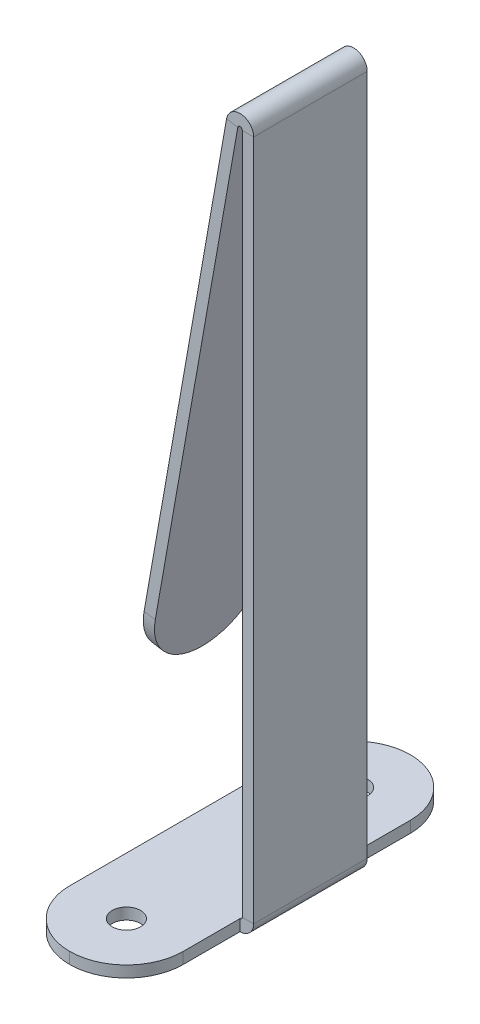
ISO-10303-21;
HEADER;
FILE_DESCRIPTION(('STEP AP214'),'2;1');
FILE_NAME('part.step','',(''),(''),'','','');
FILE_SCHEMA(('AUTOMOTIVE_DESIGN { 1 0 10303 214 1 1 1 1 }'));
ENDSEC;
DATA;
#1=APPLICATION_CONTEXT('core data for automotive mechanical design processes');
#2=APPLICATION_PROTOCOL_DEFINITION('international standard','automotive_design',2000,#1);
#3=PRODUCT_CONTEXT('',#1,'mechanical');
#4=PRODUCT('Part','Part','',(#3));
#5=PRODUCT_RELATED_PRODUCT_CATEGORY('part','',(#4));
#6=PRODUCT_DEFINITION_FORMATION('','',#4);
#7=PRODUCT_DEFINITION_CONTEXT('part definition',#1,'design');
#8=PRODUCT_DEFINITION('design','',#6,#7);
#9=PRODUCT_DEFINITION_SHAPE('','',#8);
#10=(LENGTH_UNIT() NAMED_UNIT(*) SI_UNIT(.MILLI.,.METRE.));
#11=(NAMED_UNIT(*) PLANE_ANGLE_UNIT() SI_UNIT($,.RADIAN.));
#12=(NAMED_UNIT(*) SI_UNIT($,.STERADIAN.) SOLID_ANGLE_UNIT());
#13=UNCERTAINTY_MEASURE_WITH_UNIT(LENGTH_MEASURE(1.E-05),#10,'distance_accuracy_value','');
#14=(GEOMETRIC_REPRESENTATION_CONTEXT(3) GLOBAL_UNCERTAINTY_ASSIGNED_CONTEXT((#13)) GLOBAL_UNIT_ASSIGNED_CONTEXT((#10,
#11,#12)) REPRESENTATION_CONTEXT('',''));
#15=CARTESIAN_POINT('',(0.,0.,0.));
#16=DIRECTION('',(0.,0.,1.));
#17=DIRECTION('',(1.,0.,0.));
#18=AXIS2_PLACEMENT_3D('',#15,#16,#17);
#19=CARTESIAN_POINT('',(14.224,-13.8424379345207,0.));
#20=DIRECTION('',(1.,0.,0.));
#21=DIRECTION('',(0.,0.,-1.));
#22=AXIS2_PLACEMENT_3D('',#19,#20,#21);
#23=PLANE('',#22);
#24=DIRECTION('',(0.,-1.,0.));
#25=VECTOR('',#24,1.);
#26=CARTESIAN_POINT('',(14.224,-1.14243793452066,-25.4));
#27=LINE('',#26,#25);
#28=CARTESIAN_POINT('',(14.2239999999997,76.454,-25.4));
#29=VERTEX_POINT('',#28);
#30=CARTESIAN_POINT('',(14.224,0.254000000000003,-25.4));
#31=VERTEX_POINT('',#30);
#32=EDGE_CURVE('E51',#29,#31,#27,.T.);
#33=ORIENTED_EDGE('',*,*,#32,.F.);
#34=DIRECTION('',(0.,0.,1.));
#35=VECTOR('',#34,1.);
#36=CARTESIAN_POINT('',(14.2239999999997,76.454,0.));
#37=LINE('',#36,#35);
#38=CARTESIAN_POINT('',(14.2239999999997,76.454,-12.7));
#39=VERTEX_POINT('',#38);
#40=EDGE_CURVE('E326',#29,#39,#37,.T.);
#41=ORIENTED_EDGE('',*,*,#40,.T.);
#42=DIRECTION('',(0.,1.,0.));
#43=VECTOR('',#42,1.);
#44=CARTESIAN_POINT('',(14.224,-1.14243793452066,-12.7));
#45=LINE('',#44,#43);
#46=CARTESIAN_POINT('',(14.224,0.254000000000008,-12.7));
#47=VERTEX_POINT('',#46);
#48=EDGE_CURVE('E333',#47,#39,#45,.T.);
#49=ORIENTED_EDGE('',*,*,#48,.F.);
#50=DIRECTION('',(0.,0.,1.));
#51=VECTOR('',#50,1.);
#52=CARTESIAN_POINT('',(14.224,0.254000000000004,0.));
#53=LINE('',#52,#51);
#54=EDGE_CURVE('E315',#31,#47,#53,.T.);
#55=ORIENTED_EDGE('',*,*,#54,.F.);
#56=EDGE_LOOP('',(#33,#41,#49,#55));
#57=FACE_BOUND('',#56,.T.);
#58=ADVANCED_FACE('F47',(#57),#23,.T.);
#59=CARTESIAN_POINT('',(14.224,-1.14243793452066,-12.7));
#60=DIRECTION('',(0.,0.,1.));
#61=DIRECTION('',(0.,1.,0.));
#62=AXIS2_PLACEMENT_3D('',#59,#60,#61);
#63=PLANE('',#62);
#64=ORIENTED_EDGE('',*,*,#48,.T.);
#65=DIRECTION('',(-1.,0.,0.));
#66=VECTOR('',#65,1.);
#67=CARTESIAN_POINT('',(14.2239999999997,76.454,-12.7));
#68=LINE('',#67,#66);
#69=CARTESIAN_POINT('',(12.9539999999997,76.454,-12.7));
#70=VERTEX_POINT('',#69);
#71=EDGE_CURVE('E12',#39,#70,#68,.T.);
#72=ORIENTED_EDGE('',*,*,#71,.T.);
#73=DIRECTION('',(0.,1.,0.));
#74=VECTOR('',#73,1.);
#75=CARTESIAN_POINT('',(12.954,-1.14243793452067,-12.7));
#76=LINE('',#75,#74);
#77=CARTESIAN_POINT('',(12.954,0.253999999999999,-12.7));
#78=VERTEX_POINT('',#77);
#79=EDGE_CURVE('E246',#78,#70,#76,.T.);
#80=ORIENTED_EDGE('',*,*,#79,.F.);
#81=DIRECTION('',(-1.,0.,0.));
#82=VECTOR('',#81,1.);
#83=CARTESIAN_POINT('',(14.224,0.254000000000004,-12.7));
#84=LINE('',#83,#82);
#85=EDGE_CURVE('E318',#47,#78,#84,.T.);
#86=ORIENTED_EDGE('',*,*,#85,.F.);
#87=EDGE_LOOP('',(#64,#72,#80,#86));
#88=FACE_BOUND('',#87,.T.);
#89=ADVANCED_FACE('F49',(#88),#63,.T.);
#90=CARTESIAN_POINT('',(14.224,-1.14243793452066,-25.4));
#91=DIRECTION('',(0.,0.,-1.));
#92=DIRECTION('',(0.,-1.,0.));
#93=AXIS2_PLACEMENT_3D('',#90,#91,#92);
#94=PLANE('',#93);
#95=DIRECTION('',(0.,-1.,0.));
#96=VECTOR('',#95,1.);
#97=CARTESIAN_POINT('',(12.954,-1.14243793452067,-25.4));
#98=LINE('',#97,#96);
#99=CARTESIAN_POINT('',(12.9539999999997,76.454,-25.4));
#100=VERTEX_POINT('',#99);
#101=CARTESIAN_POINT('',(12.954,0.253999999999999,-25.4));
#102=VERTEX_POINT('',#101);
#103=EDGE_CURVE('E70',#100,#102,#98,.T.);
#104=ORIENTED_EDGE('',*,*,#103,.F.);
#105=DIRECTION('',(1.,0.,0.));
#106=VECTOR('',#105,1.);
#107=CARTESIAN_POINT('',(14.2239999999997,76.454,-25.4));
#108=LINE('',#107,#106);
#109=EDGE_CURVE('E329',#100,#29,#108,.T.);
#110=ORIENTED_EDGE('',*,*,#109,.T.);
#111=ORIENTED_EDGE('',*,*,#32,.T.);
#112=DIRECTION('',(1.,0.,0.));
#113=VECTOR('',#112,1.);
#114=CARTESIAN_POINT('',(14.224,0.254000000000004,-25.4));
#115=LINE('',#114,#113);
#116=EDGE_CURVE('E323',#102,#31,#115,.T.);
#117=ORIENTED_EDGE('',*,*,#116,.F.);
#118=EDGE_LOOP('',(#104,#110,#111,#117));
#119=FACE_BOUND('',#118,.T.);
#120=ADVANCED_FACE('F351',(#119),#94,.T.);
#121=CARTESIAN_POINT('',(12.954,-13.8424379345207,0.));
#122=DIRECTION('',(1.,0.,0.));
#123=DIRECTION('',(0.,0.,-1.));
#124=AXIS2_PLACEMENT_3D('',#121,#122,#123);
#125=PLANE('',#124);
#126=DIRECTION('',(0.,0.,1.));
#127=VECTOR('',#126,1.);
#128=CARTESIAN_POINT('',(12.9539999999997,76.454,0.));
#129=LINE('',#128,#127);
#130=EDGE_CURVE('E56',#100,#70,#129,.T.);
#131=ORIENTED_EDGE('',*,*,#130,.F.);
#132=ORIENTED_EDGE('',*,*,#103,.T.);
#133=DIRECTION('',(0.,0.,1.));
#134=VECTOR('',#133,1.);
#135=CARTESIAN_POINT('',(12.954,0.253999999999999,0.));
#136=LINE('',#135,#134);
#137=EDGE_CURVE('E321',#102,#78,#136,.T.);
#138=ORIENTED_EDGE('',*,*,#137,.T.);
#139=ORIENTED_EDGE('',*,*,#79,.T.);
#140=EDGE_LOOP('',(#131,#132,#138,#139));
#141=FACE_BOUND('',#140,.T.);
#142=ADVANCED_FACE('F337',(#141),#125,.F.);
#143=CARTESIAN_POINT('',(6.35,-1.27,-31.75));
#144=DIRECTION('',(0.,1.,0.));
#145=DIRECTION('',(0.,0.,1.));
#146=AXIS2_PLACEMENT_3D('',#143,#144,#145);
#147=CYLINDRICAL_SURFACE('',#146,6.35);
#148=CARTESIAN_POINT('',(6.35,-1.27,-31.75));
#149=DIRECTION('',(0.,-1.,0.));
#150=DIRECTION('',(0.,0.,-1.));
#151=AXIS2_PLACEMENT_3D('',#148,#149,#150);
#152=CIRCLE('',#151,6.35);
#153=CARTESIAN_POINT('',(6.35,-1.27,-38.1));
#154=VERTEX_POINT('',#153);
#155=CARTESIAN_POINT('',(12.7,-1.27,-31.75));
#156=VERTEX_POINT('',#155);
#157=EDGE_CURVE('E276',#154,#156,#152,.T.);
#158=ORIENTED_EDGE('',*,*,#157,.F.);
#159=DIRECTION('',(0.,1.,0.));
#160=VECTOR('',#159,1.);
#161=CARTESIAN_POINT('',(6.35,-1.27,-38.1));
#162=LINE('',#161,#160);
#163=CARTESIAN_POINT('',(6.35,0.,-38.1));
#164=VERTEX_POINT('',#163);
#165=EDGE_CURVE('E309',#154,#164,#162,.T.);
#166=ORIENTED_EDGE('',*,*,#165,.T.);
#167=CARTESIAN_POINT('',(6.35,0.,-31.75));
#168=DIRECTION('',(0.,-1.,0.));
#169=DIRECTION('',(0.,0.,-1.));
#170=AXIS2_PLACEMENT_3D('',#167,#168,#169);
#171=CIRCLE('',#170,6.35);
#172=CARTESIAN_POINT('',(12.7,0.,-31.75));
#173=VERTEX_POINT('',#172);
#174=EDGE_CURVE('E262',#173,#164,#171,.F.);
#175=ORIENTED_EDGE('',*,*,#174,.F.);
#176=DIRECTION('',(0.,1.,0.));
#177=VECTOR('',#176,1.);
#178=CARTESIAN_POINT('',(12.7,-1.27,-31.75));
#179=LINE('',#178,#177);
#180=EDGE_CURVE('E243',#156,#173,#179,.T.);
#181=ORIENTED_EDGE('',*,*,#180,.F.);
#182=EDGE_LOOP('',(#158,#166,#175,#181));
#183=FACE_BOUND('',#182,.T.);
#184=ADVANCED_FACE('F385',(#183),#147,.T.);
#185=CARTESIAN_POINT('',(6.35,-1.27,-31.75));
#186=DIRECTION('',(0.,1.,0.));
#187=DIRECTION('',(0.,0.,1.));
#188=AXIS2_PLACEMENT_3D('',#185,#186,#187);
#189=CYLINDRICAL_SURFACE('',#188,6.35);
#190=ORIENTED_EDGE('',*,*,#165,.F.);
#191=CARTESIAN_POINT('',(6.35,-1.27,-31.75));
#192=DIRECTION('',(0.,-1.,0.));
#193=DIRECTION('',(0.,0.,-1.));
#194=AXIS2_PLACEMENT_3D('',#191,#192,#193);
#195=CIRCLE('',#194,6.35);
#196=CARTESIAN_POINT('',(0.,-1.27,-31.75));
#197=VERTEX_POINT('',#196);
#198=EDGE_CURVE('E278',#197,#154,#195,.T.);
#199=ORIENTED_EDGE('',*,*,#198,.F.);
#200=DIRECTION('',(0.,1.,0.));
#201=VECTOR('',#200,1.);
#202=CARTESIAN_POINT('',(0.,-1.27,-31.75));
#203=LINE('',#202,#201);
#204=CARTESIAN_POINT('',(0.,0.,-31.75));
#205=VERTEX_POINT('',#204);
#206=EDGE_CURVE('E302',#205,#197,#203,.F.);
#207=ORIENTED_EDGE('',*,*,#206,.F.);
#208=CARTESIAN_POINT('',(6.35,0.,-31.75));
#209=DIRECTION('',(0.,-1.,0.));
#210=DIRECTION('',(0.,0.,-1.));
#211=AXIS2_PLACEMENT_3D('',#208,#209,#210);
#212=CIRCLE('',#211,6.35);
#213=EDGE_CURVE('E260',#164,#205,#212,.F.);
#214=ORIENTED_EDGE('',*,*,#213,.F.);
#215=EDGE_LOOP('',(#190,#199,#207,#214));
#216=FACE_BOUND('',#215,.T.);
#217=ADVANCED_FACE('F389',(#216),#189,.T.);
#218=CARTESIAN_POINT('',(0.,-1.27,0.));
#219=DIRECTION('',(-1.,0.,0.));
#220=DIRECTION('',(0.,0.,1.));
#221=AXIS2_PLACEMENT_3D('',#218,#219,#220);
#222=PLANE('',#221);
#223=DIRECTION('',(0.,0.,1.));
#224=VECTOR('',#223,1.);
#225=CARTESIAN_POINT('',(0.,-1.27,0.));
#226=LINE('',#225,#224);
#227=CARTESIAN_POINT('',(0.,-1.27,-6.35));
#228=VERTEX_POINT('',#227);
#229=EDGE_CURVE('E306',#197,#228,#226,.T.);
#230=ORIENTED_EDGE('',*,*,#229,.T.);
#231=DIRECTION('',(0.,1.,0.));
#232=VECTOR('',#231,1.);
#233=CARTESIAN_POINT('',(0.,-1.27,-6.35));
#234=LINE('',#233,#232);
#235=CARTESIAN_POINT('',(0.,0.,-6.35));
#236=VERTEX_POINT('',#235);
#237=EDGE_CURVE('E304',#228,#236,#234,.T.);
#238=ORIENTED_EDGE('',*,*,#237,.T.);
#239=DIRECTION('',(0.,0.,1.));
#240=VECTOR('',#239,1.);
#241=CARTESIAN_POINT('',(0.,0.,0.));
#242=LINE('',#241,#240);
#243=EDGE_CURVE('E257',#205,#236,#242,.T.);
#244=ORIENTED_EDGE('',*,*,#243,.F.);
#245=ORIENTED_EDGE('',*,*,#206,.T.);
#246=EDGE_LOOP('',(#230,#238,#244,#245));
#247=FACE_BOUND('',#246,.T.);
#248=ADVANCED_FACE('F395',(#247),#222,.T.);
#249=CARTESIAN_POINT('',(6.35,-1.27,-6.35));
#250=DIRECTION('',(0.,1.,0.));
#251=DIRECTION('',(0.,0.,1.));
#252=AXIS2_PLACEMENT_3D('',#249,#250,#251);
#253=CYLINDRICAL_SURFACE('',#252,6.35);
#254=ORIENTED_EDGE('',*,*,#237,.F.);
#255=CARTESIAN_POINT('',(6.35,-1.27,-6.35));
#256=DIRECTION('',(0.,-1.,0.));
#257=DIRECTION('',(0.,0.,-1.));
#258=AXIS2_PLACEMENT_3D('',#255,#256,#257);
#259=CIRCLE('',#258,6.35);
#260=CARTESIAN_POINT('',(6.35,-1.27,0.));
#261=VERTEX_POINT('',#260);
#262=EDGE_CURVE('E280',#261,#228,#259,.T.);
#263=ORIENTED_EDGE('',*,*,#262,.F.);
#264=DIRECTION('',(0.,1.,0.));
#265=VECTOR('',#264,1.);
#266=CARTESIAN_POINT('',(6.35,-1.27,0.));
#267=LINE('',#266,#265);
#268=CARTESIAN_POINT('',(6.35,0.,0.));
#269=VERTEX_POINT('',#268);
#270=EDGE_CURVE('E299',#269,#261,#267,.F.);
#271=ORIENTED_EDGE('',*,*,#270,.F.);
#272=CARTESIAN_POINT('',(6.35,0.,-6.35));
#273=DIRECTION('',(0.,-1.,0.));
#274=DIRECTION('',(0.,0.,-1.));
#275=AXIS2_PLACEMENT_3D('',#272,#273,#274);
#276=CIRCLE('',#275,6.35);
#277=EDGE_CURVE('E255',#236,#269,#276,.F.);
#278=ORIENTED_EDGE('',*,*,#277,.F.);
#279=EDGE_LOOP('',(#254,#263,#271,#278));
#280=FACE_BOUND('',#279,.T.);
#281=ADVANCED_FACE('F405',(#280),#253,.T.);
#282=CARTESIAN_POINT('',(6.34999999999999,-1.27,-6.35));
#283=DIRECTION('',(0.,1.,0.));
#284=DIRECTION('',(0.,0.,1.));
#285=AXIS2_PLACEMENT_3D('',#282,#283,#284);
#286=CYLINDRICAL_SURFACE('',#285,6.35);
#287=CARTESIAN_POINT('',(6.34999999999999,-1.27,-6.35));
#288=DIRECTION('',(0.,-1.,0.));
#289=DIRECTION('',(0.,0.,-1.));
#290=AXIS2_PLACEMENT_3D('',#287,#288,#289);
#291=CIRCLE('',#290,6.35);
#292=CARTESIAN_POINT('',(12.7,-1.27,-6.34999999999999));
#293=VERTEX_POINT('',#292);
#294=EDGE_CURVE('E282',#293,#261,#291,.T.);
#295=ORIENTED_EDGE('',*,*,#294,.F.);
#296=DIRECTION('',(0.,1.,0.));
#297=VECTOR('',#296,1.);
#298=CARTESIAN_POINT('',(12.7,-1.27,-6.34999999999999));
#299=LINE('',#298,#297);
#300=CARTESIAN_POINT('',(12.7,0.,-6.34999999999999));
#301=VERTEX_POINT('',#300);
#302=EDGE_CURVE('E273',#301,#293,#299,.F.);
#303=ORIENTED_EDGE('',*,*,#302,.F.);
#304=CARTESIAN_POINT('',(6.34999999999999,0.,-6.35));
#305=DIRECTION('',(0.,-1.,0.));
#306=DIRECTION('',(0.,0.,-1.));
#307=AXIS2_PLACEMENT_3D('',#304,#305,#306);
#308=CIRCLE('',#307,6.35);
#309=EDGE_CURVE('E253',#269,#301,#308,.F.);
#310=ORIENTED_EDGE('',*,*,#309,.F.);
#311=ORIENTED_EDGE('',*,*,#270,.T.);
#312=EDGE_LOOP('',(#295,#303,#310,#311));
#313=FACE_BOUND('',#312,.T.);
#314=ADVANCED_FACE('F409',(#313),#286,.T.);
#315=CARTESIAN_POINT('',(6.35000000000001,-2.54,-6.35));
#316=DIRECTION('',(0.,1.,0.));
#317=DIRECTION('',(0.,0.,1.));
#318=AXIS2_PLACEMENT_3D('',#315,#316,#317);
#319=CYLINDRICAL_SURFACE('',#318,1.5875);
#320=CARTESIAN_POINT('',(6.35000000000001,-1.27,-6.35));
#321=DIRECTION('',(0.,-1.,0.));
#322=DIRECTION('',(0.,0.,-1.));
#323=AXIS2_PLACEMENT_3D('',#320,#321,#322);
#324=CIRCLE('',#323,1.5875);
#325=CARTESIAN_POINT('',(6.35000000000001,-1.27,-7.9375));
#326=VERTEX_POINT('',#325);
#327=EDGE_CURVE('E296',#326,#326,#324,.T.);
#328=ORIENTED_EDGE('',*,*,#327,.T.);
#329=EDGE_LOOP('',(#328));
#330=FACE_BOUND('',#329,.T.);
#331=CARTESIAN_POINT('',(6.35000000000001,0.,-6.35));
#332=DIRECTION('',(0.,1.,0.));
#333=DIRECTION('',(0.,0.,1.));
#334=AXIS2_PLACEMENT_3D('',#331,#332,#333);
#335=CIRCLE('',#334,1.5875);
#336=CARTESIAN_POINT('',(6.35000000000001,0.,-4.7625));
#337=VERTEX_POINT('',#336);
#338=EDGE_CURVE('E293',#337,#337,#335,.T.);
#339=ORIENTED_EDGE('',*,*,#338,.T.);
#340=EDGE_LOOP('',(#339));
#341=FACE_BOUND('',#340,.T.);
#342=ADVANCED_FACE('F413',(#330,#341),#319,.F.);
#343=CARTESIAN_POINT('',(6.34999999999999,-2.54,-31.75));
#344=DIRECTION('',(0.,1.,0.));
#345=DIRECTION('',(0.,0.,1.));
#346=AXIS2_PLACEMENT_3D('',#343,#344,#345);
#347=CYLINDRICAL_SURFACE('',#346,1.5875);
#348=CARTESIAN_POINT('',(6.34999999999999,-1.27,-31.75));
#349=DIRECTION('',(0.,-1.,0.));
#350=DIRECTION('',(0.,0.,-1.));
#351=AXIS2_PLACEMENT_3D('',#348,#349,#350);
#352=CIRCLE('',#351,1.5875);
#353=CARTESIAN_POINT('',(6.34999999999999,-1.27,-33.3375));
#354=VERTEX_POINT('',#353);
#355=EDGE_CURVE('E290',#354,#354,#352,.T.);
#356=ORIENTED_EDGE('',*,*,#355,.T.);
#357=EDGE_LOOP('',(#356));
#358=FACE_BOUND('',#357,.T.);
#359=CARTESIAN_POINT('',(6.34999999999999,0.,-31.75));
#360=DIRECTION('',(0.,1.,0.));
#361=DIRECTION('',(0.,0.,1.));
#362=AXIS2_PLACEMENT_3D('',#359,#360,#361);
#363=CIRCLE('',#362,1.5875);
#364=CARTESIAN_POINT('',(6.34999999999999,0.,-30.1625));
#365=VERTEX_POINT('',#364);
#366=EDGE_CURVE('E287',#365,#365,#363,.T.);
#367=ORIENTED_EDGE('',*,*,#366,.T.);
#368=EDGE_LOOP('',(#367));
#369=FACE_BOUND('',#368,.T.);
#370=ADVANCED_FACE('F417',(#358,#369),#347,.F.);
#371=CARTESIAN_POINT('',(0.,-1.27,0.));
#372=DIRECTION('',(0.,-1.,0.));
#373=DIRECTION('',(0.,0.,-1.));
#374=AXIS2_PLACEMENT_3D('',#371,#372,#373);
#375=PLANE('',#374);
#376=ORIENTED_EDGE('',*,*,#355,.F.);
#377=EDGE_LOOP('',(#376));
#378=FACE_BOUND('',#377,.T.);
#379=ORIENTED_EDGE('',*,*,#327,.F.);
#380=EDGE_LOOP('',(#379));
#381=FACE_BOUND('',#380,.T.);
#382=DIRECTION('',(0.,0.,-1.));
#383=VECTOR('',#382,1.);
#384=CARTESIAN_POINT('',(12.7,-1.27,-38.1));
#385=LINE('',#384,#383);
#386=CARTESIAN_POINT('',(12.7,-1.27,-25.4));
#387=VERTEX_POINT('',#386);
#388=EDGE_CURVE('E247',#387,#156,#385,.T.);
#389=ORIENTED_EDGE('',*,*,#388,.F.);
#390=DIRECTION('',(0.,0.,1.));
#391=VECTOR('',#390,1.);
#392=CARTESIAN_POINT('',(12.7,-1.27,0.));
#393=LINE('',#392,#391);
#394=CARTESIAN_POINT('',(12.7,-1.27,-12.7));
#395=VERTEX_POINT('',#394);
#396=EDGE_CURVE('E284',#387,#395,#393,.T.);
#397=ORIENTED_EDGE('',*,*,#396,.T.);
#398=DIRECTION('',(0.,0.,-1.));
#399=VECTOR('',#398,1.);
#400=CARTESIAN_POINT('',(12.7,-1.27,-12.7));
#401=LINE('',#400,#399);
#402=EDGE_CURVE('E270',#293,#395,#401,.T.);
#403=ORIENTED_EDGE('',*,*,#402,.F.);
#404=ORIENTED_EDGE('',*,*,#294,.T.);
#405=ORIENTED_EDGE('',*,*,#262,.T.);
#406=ORIENTED_EDGE('',*,*,#229,.F.);
#407=ORIENTED_EDGE('',*,*,#198,.T.);
#408=ORIENTED_EDGE('',*,*,#157,.T.);
#409=EDGE_LOOP('',(#389,#397,#403,#404,#405,#406,#407,#408));
#410=FACE_BOUND('',#409,.T.);
#411=ADVANCED_FACE('F421',(#378,#381,#410),#375,.T.);
#412=CARTESIAN_POINT('',(12.7,-1.27,-12.7));
#413=DIRECTION('',(1.,0.,0.));
#414=DIRECTION('',(0.,0.,-1.));
#415=AXIS2_PLACEMENT_3D('',#412,#413,#414);
#416=PLANE('',#415);
#417=DIRECTION('',(0.,0.,-1.));
#418=VECTOR('',#417,1.);
#419=CARTESIAN_POINT('',(12.7,0.,-12.7));
#420=LINE('',#419,#418);
#421=CARTESIAN_POINT('',(12.7,0.,-12.7));
#422=VERTEX_POINT('',#421);
#423=EDGE_CURVE('E250',#301,#422,#420,.T.);
#424=ORIENTED_EDGE('',*,*,#423,.F.);
#425=ORIENTED_EDGE('',*,*,#302,.T.);
#426=ORIENTED_EDGE('',*,*,#402,.T.);
#427=DIRECTION('',(0.,1.,0.));
#428=VECTOR('',#427,1.);
#429=CARTESIAN_POINT('',(12.7,-1.27,-12.7));
#430=LINE('',#429,#428);
#431=EDGE_CURVE('E267',#395,#422,#430,.T.);
#432=ORIENTED_EDGE('',*,*,#431,.T.);
#433=EDGE_LOOP('',(#424,#425,#426,#432));
#434=FACE_BOUND('',#433,.T.);
#435=ADVANCED_FACE('F425',(#434),#416,.T.);
#436=CARTESIAN_POINT('',(0.,0.,0.));
#437=DIRECTION('',(0.,-1.,0.));
#438=DIRECTION('',(0.,0.,-1.));
#439=AXIS2_PLACEMENT_3D('',#436,#437,#438);
#440=PLANE('',#439);
#441=DIRECTION('',(0.,0.,1.));
#442=VECTOR('',#441,1.);
#443=CARTESIAN_POINT('',(12.7,0.,0.));
#444=LINE('',#443,#442);
#445=CARTESIAN_POINT('',(12.7,0.,-25.4));
#446=VERTEX_POINT('',#445);
#447=EDGE_CURVE('E312',#446,#422,#444,.T.);
#448=ORIENTED_EDGE('',*,*,#447,.F.);
#449=DIRECTION('',(0.,0.,-1.));
#450=VECTOR('',#449,1.);
#451=CARTESIAN_POINT('',(12.7,0.,-38.1));
#452=LINE('',#451,#450);
#453=EDGE_CURVE('E264',#446,#173,#452,.T.);
#454=ORIENTED_EDGE('',*,*,#453,.T.);
#455=ORIENTED_EDGE('',*,*,#174,.T.);
#456=ORIENTED_EDGE('',*,*,#213,.T.);
#457=ORIENTED_EDGE('',*,*,#243,.T.);
#458=ORIENTED_EDGE('',*,*,#277,.T.);
#459=ORIENTED_EDGE('',*,*,#309,.T.);
#460=ORIENTED_EDGE('',*,*,#423,.T.);
#461=EDGE_LOOP('',(#448,#454,#455,#456,#457,#458,#459,#460));
#462=FACE_BOUND('',#461,.T.);
#463=ORIENTED_EDGE('',*,*,#338,.F.);
#464=EDGE_LOOP('',(#463));
#465=FACE_BOUND('',#464,.T.);
#466=ORIENTED_EDGE('',*,*,#366,.F.);
#467=EDGE_LOOP('',(#466));
#468=FACE_BOUND('',#467,.T.);
#469=ADVANCED_FACE('F428',(#462,#465,#468),#440,.F.);
#470=CARTESIAN_POINT('',(12.7,-1.27,-38.1));
#471=DIRECTION('',(1.,0.,0.));
#472=DIRECTION('',(0.,0.,-1.));
#473=AXIS2_PLACEMENT_3D('',#470,#471,#472);
#474=PLANE('',#473);
#475=ORIENTED_EDGE('',*,*,#388,.T.);
#476=ORIENTED_EDGE('',*,*,#180,.T.);
#477=ORIENTED_EDGE('',*,*,#453,.F.);
#478=DIRECTION('',(0.,1.,0.));
#479=VECTOR('',#478,1.);
#480=CARTESIAN_POINT('',(12.7,-1.27,-25.4));
#481=LINE('',#480,#479);
#482=EDGE_CURVE('E238',#387,#446,#481,.T.);
#483=ORIENTED_EDGE('',*,*,#482,.F.);
#484=EDGE_LOOP('',(#475,#476,#477,#483));
#485=FACE_BOUND('',#484,.T.);
#486=ADVANCED_FACE('F381',(#485),#474,.T.);
#487=CARTESIAN_POINT('',(12.7,0.254,-25.4));
#488=DIRECTION('',(0.,0.,-1.));
#489=DIRECTION('',(-1.,0.,0.));
#490=AXIS2_PLACEMENT_3D('',#487,#488,#489);
#491=PLANE('',#490);
#492=ORIENTED_EDGE('',*,*,#482,.T.);
#493=CARTESIAN_POINT('',(12.7,0.254,-25.4));
#494=DIRECTION('',(0.,0.,1.));
#495=DIRECTION('',(1.,0.,0.));
#496=AXIS2_PLACEMENT_3D('',#493,#494,#495);
#497=CIRCLE('',#496,0.254);
#498=EDGE_CURVE('E229',#446,#102,#497,.T.);
#499=ORIENTED_EDGE('',*,*,#498,.T.);
#500=ORIENTED_EDGE('',*,*,#116,.T.);
#501=CARTESIAN_POINT('',(12.7,0.254,-25.4));
#502=DIRECTION('',(0.,0.,1.));
#503=DIRECTION('',(-1.,0.,0.));
#504=AXIS2_PLACEMENT_3D('',#501,#502,#503);
#505=CIRCLE('',#504,1.524);
#506=EDGE_CURVE('E231',#387,#31,#505,.T.);
#507=ORIENTED_EDGE('',*,*,#506,.F.);
#508=EDGE_LOOP('',(#492,#499,#500,#507));
#509=FACE_BOUND('',#508,.T.);
#510=ADVANCED_FACE('F400',(#509),#491,.T.);
#511=CARTESIAN_POINT('',(12.7,0.254,-12.7));
#512=DIRECTION('',(0.,0.,1.));
#513=DIRECTION('',(1.,0.,0.));
#514=AXIS2_PLACEMENT_3D('',#511,#512,#513);
#515=PLANE('',#514);
#516=ORIENTED_EDGE('',*,*,#85,.T.);
#517=CARTESIAN_POINT('',(12.7,0.254,-12.7));
#518=DIRECTION('',(0.,0.,1.));
#519=DIRECTION('',(1.,0.,0.));
#520=AXIS2_PLACEMENT_3D('',#517,#518,#519);
#521=CIRCLE('',#520,0.254);
#522=EDGE_CURVE('E235',#78,#422,#521,.F.);
#523=ORIENTED_EDGE('',*,*,#522,.T.);
#524=ORIENTED_EDGE('',*,*,#431,.F.);
#525=CARTESIAN_POINT('',(12.7,0.254,-12.7));
#526=DIRECTION('',(0.,0.,-1.));
#527=DIRECTION('',(1.,0.,0.));
#528=AXIS2_PLACEMENT_3D('',#525,#526,#527);
#529=CIRCLE('',#528,1.524);
#530=EDGE_CURVE('E234',#47,#395,#529,.T.);
#531=ORIENTED_EDGE('',*,*,#530,.F.);
#532=EDGE_LOOP('',(#516,#523,#524,#531));
#533=FACE_BOUND('',#532,.T.);
#534=ADVANCED_FACE('F450',(#533),#515,.T.);
#535=CARTESIAN_POINT('',(12.7,0.254,-31.8895069572382));
#536=DIRECTION('',(0.,0.,1.));
#537=DIRECTION('',(1.,0.,0.));
#538=AXIS2_PLACEMENT_3D('',#535,#536,#537);
#539=CYLINDRICAL_SURFACE('',#538,1.524);
#540=ORIENTED_EDGE('',*,*,#530,.T.);
#541=ORIENTED_EDGE('',*,*,#396,.F.);
#542=ORIENTED_EDGE('',*,*,#506,.T.);
#543=ORIENTED_EDGE('',*,*,#54,.T.);
#544=EDGE_LOOP('',(#540,#541,#542,#543));
#545=FACE_BOUND('',#544,.T.);
#546=ADVANCED_FACE('F454',(#545),#539,.T.);
#547=CARTESIAN_POINT('',(12.7,0.254,-31.8895069572382));
#548=DIRECTION('',(0.,0.,1.));
#549=DIRECTION('',(1.,0.,0.));
#550=AXIS2_PLACEMENT_3D('',#547,#548,#549);
#551=CYLINDRICAL_SURFACE('',#550,0.254);
#552=ORIENTED_EDGE('',*,*,#522,.F.);
#553=ORIENTED_EDGE('',*,*,#137,.F.);
#554=ORIENTED_EDGE('',*,*,#498,.F.);
#555=ORIENTED_EDGE('',*,*,#447,.T.);
#556=EDGE_LOOP('',(#552,#553,#554,#555));
#557=FACE_BOUND('',#556,.T.);
#558=ADVANCED_FACE('F448',(#557),#551,.F.);
#559=CARTESIAN_POINT('',(12.6999999999997,76.454,-25.4));
#560=DIRECTION('',(0.,0.,-1.));
#561=DIRECTION('',(-1.,0.,0.));
#562=AXIS2_PLACEMENT_3D('',#559,#560,#561);
#563=PLANE('',#562);
#564=ORIENTED_EDGE('',*,*,#109,.F.);
#565=CARTESIAN_POINT('',(12.6999999999997,76.454,-25.4));
#566=DIRECTION('',(0.,0.,1.));
#567=DIRECTION('',(1.,0.,0.));
#568=AXIS2_PLACEMENT_3D('',#565,#566,#567);
#569=CIRCLE('',#568,0.254);
#570=CARTESIAN_POINT('',(12.4498588307346,76.4981066371274,-25.4));
#571=VERTEX_POINT('',#570);
#572=EDGE_CURVE('E195',#100,#571,#569,.T.);
#573=ORIENTED_EDGE('',*,*,#572,.T.);
#574=DIRECTION('',(-0.98480775301221,0.173648177666921,0.));
#575=VECTOR('',#574,1.);
#576=CARTESIAN_POINT('',(11.1991529844091,76.7186398227644,-25.4));
#577=LINE('',#576,#575);
#578=CARTESIAN_POINT('',(11.1991529844091,76.7186398227644,-25.4));
#579=VERTEX_POINT('',#578);
#580=EDGE_CURVE('E217',#571,#579,#577,.T.);
#581=ORIENTED_EDGE('',*,*,#580,.T.);
#582=CARTESIAN_POINT('',(12.6999999999997,76.454,-25.4));
#583=DIRECTION('',(0.,0.,1.));
#584=DIRECTION('',(-1.,0.,0.));
#585=AXIS2_PLACEMENT_3D('',#582,#583,#584);
#586=CIRCLE('',#585,1.524);
#587=EDGE_CURVE('E223',#29,#579,#586,.T.);
#588=ORIENTED_EDGE('',*,*,#587,.F.);
#589=EDGE_LOOP('',(#564,#573,#581,#588));
#590=FACE_BOUND('',#589,.T.);
#591=ADVANCED_FACE('F353',(#590),#563,.T.);
#592=CARTESIAN_POINT('',(12.6999999999997,76.454,-12.7));
#593=DIRECTION('',(0.,0.,1.));
#594=DIRECTION('',(1.,0.,0.));
#595=AXIS2_PLACEMENT_3D('',#592,#593,#594);
#596=PLANE('',#595);
#597=DIRECTION('',(0.98480775301221,-0.173648177666921,0.));
#598=VECTOR('',#597,1.);
#599=CARTESIAN_POINT('',(11.1991529844091,76.7186398227644,-12.7));
#600=LINE('',#599,#598);
#601=CARTESIAN_POINT('',(11.1991529844091,76.7186398227644,-12.7));
#602=VERTEX_POINT('',#601);
#603=CARTESIAN_POINT('',(12.4498588307346,76.4981066371274,-12.7));
#604=VERTEX_POINT('',#603);
#605=EDGE_CURVE('E176',#602,#604,#600,.T.);
#606=ORIENTED_EDGE('',*,*,#605,.T.);
#607=CARTESIAN_POINT('',(12.6999999999997,76.454,-12.7));
#608=DIRECTION('',(0.,0.,1.));
#609=DIRECTION('',(1.,0.,0.));
#610=AXIS2_PLACEMENT_3D('',#607,#608,#609);
#611=CIRCLE('',#610,0.254);
#612=EDGE_CURVE('E198',#604,#70,#611,.F.);
#613=ORIENTED_EDGE('',*,*,#612,.T.);
#614=ORIENTED_EDGE('',*,*,#71,.F.);
#615=CARTESIAN_POINT('',(12.6999999999997,76.454,-12.7));
#616=DIRECTION('',(0.,0.,-1.));
#617=DIRECTION('',(1.,0.,0.));
#618=AXIS2_PLACEMENT_3D('',#615,#616,#617);
#619=CIRCLE('',#618,1.524);
#620=EDGE_CURVE('E226',#602,#39,#619,.T.);
#621=ORIENTED_EDGE('',*,*,#620,.F.);
#622=EDGE_LOOP('',(#606,#613,#614,#621));
#623=FACE_BOUND('',#622,.T.);
#624=ADVANCED_FACE('F343',(#623),#596,.T.);
#625=CARTESIAN_POINT('',(12.6999999999997,76.454,-32.0830520683565));
#626=DIRECTION('',(0.,0.,1.));
#627=DIRECTION('',(1.,0.,0.));
#628=AXIS2_PLACEMENT_3D('',#625,#626,#627);
#629=CYLINDRICAL_SURFACE('',#628,1.524);
#630=ORIENTED_EDGE('',*,*,#620,.T.);
#631=ORIENTED_EDGE('',*,*,#40,.F.);
#632=ORIENTED_EDGE('',*,*,#587,.T.);
#633=DIRECTION('',(0.,0.,1.));
#634=VECTOR('',#633,1.);
#635=CARTESIAN_POINT('',(11.1991529844091,76.7186398227644,0.));
#636=LINE('',#635,#634);
#637=EDGE_CURVE('E221',#579,#602,#636,.T.);
#638=ORIENTED_EDGE('',*,*,#637,.T.);
#639=EDGE_LOOP('',(#630,#631,#632,#638));
#640=FACE_BOUND('',#639,.T.);
#641=ADVANCED_FACE('F346',(#640),#629,.T.);
#642=CARTESIAN_POINT('',(12.6999999999997,76.454,-32.0830520683565));
#643=DIRECTION('',(0.,0.,1.));
#644=DIRECTION('',(1.,0.,0.));
#645=AXIS2_PLACEMENT_3D('',#642,#643,#644);
#646=CYLINDRICAL_SURFACE('',#645,0.254);
#647=ORIENTED_EDGE('',*,*,#612,.F.);
#648=DIRECTION('',(0.,0.,1.));
#649=VECTOR('',#648,1.);
#650=CARTESIAN_POINT('',(12.4498588307346,76.4981066371274,0.));
#651=LINE('',#650,#649);
#652=EDGE_CURVE('E205',#571,#604,#651,.T.);
#653=ORIENTED_EDGE('',*,*,#652,.F.);
#654=ORIENTED_EDGE('',*,*,#572,.F.);
#655=ORIENTED_EDGE('',*,*,#130,.T.);
#656=EDGE_LOOP('',(#647,#653,#654,#655));
#657=FACE_BOUND('',#656,.T.);
#658=ADVANCED_FACE('F355',(#657),#646,.F.);
#659=CARTESIAN_POINT('',(1.97568312701308,24.4097429067193,-19.0500000000001));
#660=DIRECTION('',(0.98480775301221,-0.173648177666921,0.));
#661=DIRECTION('',(0.,0.,1.));
#662=AXIS2_PLACEMENT_3D('',#659,#660,#661);
#663=CYLINDRICAL_SURFACE('',#662,6.35);
#664=CARTESIAN_POINT('',(1.97568312701308,24.4097429067193,-19.0500000000001));
#665=DIRECTION('',(-0.98480775301221,0.173648177666921,0.));
#666=DIRECTION('',(0.,0.,-1.));
#667=AXIS2_PLACEMENT_3D('',#664,#665,#666);
#668=CIRCLE('',#667,6.35);
#669=CARTESIAN_POINT('',(0.873017198828131,18.1562136750917,-19.0500000000001));
#670=VERTEX_POINT('',#669);
#671=CARTESIAN_POINT('',(1.97568312701308,24.4097429067193,-12.7000000000001));
#672=VERTEX_POINT('',#671);
#673=EDGE_CURVE('E182',#670,#672,#668,.T.);
#674=ORIENTED_EDGE('',*,*,#673,.F.);
#675=DIRECTION('',(0.98480775301221,-0.173648177666921,0.));
#676=VECTOR('',#675,1.);
#677=CARTESIAN_POINT('',(0.873017198828131,18.1562136750917,-19.0500000000001));
#678=LINE('',#677,#676);
#679=CARTESIAN_POINT('',(2.12372304515364,17.9356804894548,-19.0500000000001));
#680=VERTEX_POINT('',#679);
#681=EDGE_CURVE('E215',#670,#680,#678,.T.);
#682=ORIENTED_EDGE('',*,*,#681,.T.);
#683=CARTESIAN_POINT('',(3.22638897333859,24.1892097210823,-19.0500000000001));
#684=DIRECTION('',(-0.98480775301221,0.173648177666921,0.));
#685=DIRECTION('',(0.,0.,-1.));
#686=AXIS2_PLACEMENT_3D('',#683,#684,#685);
#687=CIRCLE('',#686,6.35);
#688=CARTESIAN_POINT('',(3.22638897333859,24.1892097210823,-12.7000000000001));
#689=VERTEX_POINT('',#688);
#690=EDGE_CURVE('E194',#689,#680,#687,.F.);
#691=ORIENTED_EDGE('',*,*,#690,.F.);
#692=DIRECTION('',(0.98480775301221,-0.173648177666921,0.));
#693=VECTOR('',#692,1.);
#694=CARTESIAN_POINT('',(1.97568312701308,24.4097429067193,-12.7000000000001));
#695=LINE('',#694,#693);
#696=EDGE_CURVE('E174',#672,#689,#695,.T.);
#697=ORIENTED_EDGE('',*,*,#696,.F.);
#698=EDGE_LOOP('',(#674,#682,#691,#697));
#699=FACE_BOUND('',#698,.T.);
#700=ADVANCED_FACE('F193',(#699),#663,.T.);
#701=CARTESIAN_POINT('',(1.97568312701308,24.4097429067193,-19.0500000000001));
#702=DIRECTION('',(0.98480775301221,-0.173648177666921,0.));
#703=DIRECTION('',(0.,0.,1.));
#704=AXIS2_PLACEMENT_3D('',#701,#702,#703);
#705=CYLINDRICAL_SURFACE('',#704,6.35);
#706=ORIENTED_EDGE('',*,*,#681,.F.);
#707=CARTESIAN_POINT('',(1.97568312701308,24.4097429067193,-19.0500000000001));
#708=DIRECTION('',(-0.98480775301221,0.173648177666921,0.));
#709=DIRECTION('',(0.,0.,-1.));
#710=AXIS2_PLACEMENT_3D('',#707,#708,#709);
#711=CIRCLE('',#710,6.35);
#712=CARTESIAN_POINT('',(1.97568312701309,24.4097429067193,-25.4000000000001));
#713=VERTEX_POINT('',#712);
#714=EDGE_CURVE('E186',#713,#670,#711,.T.);
#715=ORIENTED_EDGE('',*,*,#714,.F.);
#716=DIRECTION('',(0.98480775301221,-0.173648177666921,0.));
#717=VECTOR('',#716,1.);
#718=CARTESIAN_POINT('',(1.97568312701309,24.4097429067193,-25.4000000000001));
#719=LINE('',#718,#717);
#720=CARTESIAN_POINT('',(3.22638897333859,24.1892097210823,-25.4000000000001));
#721=VERTEX_POINT('',#720);
#722=EDGE_CURVE('E190',#721,#713,#719,.F.);
#723=ORIENTED_EDGE('',*,*,#722,.F.);
#724=CARTESIAN_POINT('',(3.22638897333859,24.1892097210823,-19.0500000000001));
#725=DIRECTION('',(-0.98480775301221,0.173648177666921,0.));
#726=DIRECTION('',(0.,0.,-1.));
#727=AXIS2_PLACEMENT_3D('',#724,#725,#726);
#728=CIRCLE('',#727,6.35);
#729=EDGE_CURVE('E179',#680,#721,#728,.F.);
#730=ORIENTED_EDGE('',*,*,#729,.F.);
#731=EDGE_LOOP('',(#706,#715,#723,#730));
#732=FACE_BOUND('',#731,.T.);
#733=ADVANCED_FACE('F365',(#732),#705,.T.);
#734=CARTESIAN_POINT('',(27.3369994752668,168.240915234152,0.));
#735=DIRECTION('',(-0.98480775301221,0.173648177666921,0.));
#736=DIRECTION('',(0.,0.,-1.));
#737=AXIS2_PLACEMENT_3D('',#734,#735,#736);
#738=PLANE('',#737);
#739=ORIENTED_EDGE('',*,*,#637,.F.);
#740=DIRECTION('',(0.173648177666921,0.98480775301221,0.));
#741=VECTOR('',#740,1.);
#742=CARTESIAN_POINT('',(25.131667618897,155.733856770897,-25.4));
#743=LINE('',#742,#741);
#744=EDGE_CURVE('E210',#713,#579,#743,.T.);
#745=ORIENTED_EDGE('',*,*,#744,.F.);
#746=ORIENTED_EDGE('',*,*,#714,.T.);
#747=ORIENTED_EDGE('',*,*,#673,.T.);
#748=DIRECTION('',(-0.173648177666921,-0.98480775301221,0.));
#749=VECTOR('',#748,1.);
#750=CARTESIAN_POINT('',(25.131667618897,155.733856770897,-12.7));
#751=LINE('',#750,#749);
#752=EDGE_CURVE('E170',#602,#672,#751,.T.);
#753=ORIENTED_EDGE('',*,*,#752,.F.);
#754=EDGE_LOOP('',(#739,#745,#746,#747,#753));
#755=FACE_BOUND('',#754,.T.);
#756=ADVANCED_FACE('F183',(#755),#738,.T.);
#757=CARTESIAN_POINT('',(25.131667618897,155.733856770897,-25.4));
#758=DIRECTION('',(0.,0.,-1.));
#759=DIRECTION('',(0.173648177666921,0.98480775301221,0.));
#760=AXIS2_PLACEMENT_3D('',#757,#758,#759);
#761=PLANE('',#760);
#762=ORIENTED_EDGE('',*,*,#580,.F.);
#763=DIRECTION('',(0.173648177666921,0.98480775301221,0.));
#764=VECTOR('',#763,1.);
#765=CARTESIAN_POINT('',(26.3823734652225,155.51332358526,-25.4));
#766=LINE('',#765,#764);
#767=EDGE_CURVE('E208',#721,#571,#766,.T.);
#768=ORIENTED_EDGE('',*,*,#767,.F.);
#769=ORIENTED_EDGE('',*,*,#722,.T.);
#770=ORIENTED_EDGE('',*,*,#744,.T.);
#771=EDGE_LOOP('',(#762,#768,#769,#770));
#772=FACE_BOUND('',#771,.T.);
#773=ADVANCED_FACE('F363',(#772),#761,.T.);
#774=CARTESIAN_POINT('',(28.5877053215923,168.020382048516,0.));
#775=DIRECTION('',(-0.98480775301221,0.173648177666921,0.));
#776=DIRECTION('',(0.,0.,-1.));
#777=AXIS2_PLACEMENT_3D('',#774,#775,#776);
#778=PLANE('',#777);
#779=ORIENTED_EDGE('',*,*,#767,.T.);
#780=ORIENTED_EDGE('',*,*,#652,.T.);
#781=DIRECTION('',(-0.173648177666921,-0.98480775301221,0.));
#782=VECTOR('',#781,1.);
#783=CARTESIAN_POINT('',(26.3823734652225,155.51332358526,-12.7));
#784=LINE('',#783,#782);
#785=EDGE_CURVE('E203',#604,#689,#784,.T.);
#786=ORIENTED_EDGE('',*,*,#785,.T.);
#787=ORIENTED_EDGE('',*,*,#690,.T.);
#788=ORIENTED_EDGE('',*,*,#729,.T.);
#789=EDGE_LOOP('',(#779,#780,#786,#787,#788));
#790=FACE_BOUND('',#789,.T.);
#791=ADVANCED_FACE('F357',(#790),#778,.F.);
#792=CARTESIAN_POINT('',(25.131667618897,155.733856770897,-12.7));
#793=DIRECTION('',(0.,0.,1.));
#794=DIRECTION('',(-0.173648177666921,-0.98480775301221,0.));
#795=AXIS2_PLACEMENT_3D('',#792,#793,#794);
#796=PLANE('',#795);
#797=ORIENTED_EDGE('',*,*,#605,.F.);
#798=ORIENTED_EDGE('',*,*,#752,.T.);
#799=ORIENTED_EDGE('',*,*,#696,.T.);
#800=ORIENTED_EDGE('',*,*,#785,.F.);
#801=EDGE_LOOP('',(#797,#798,#799,#800));
#802=FACE_BOUND('',#801,.T.);
#803=ADVANCED_FACE('F172',(#802),#796,.T.);
#804=CLOSED_SHELL('',(#58,#89,#120,#142,#184,#217,#248,#281,#314,#342,#370,#411,#435,#469,#486,
#510,#534,#546,#558,#591,#624,#641,#658,#700,#733,#756,#773,#791,#803));
#805=MANIFOLD_SOLID_BREP('B2',#804);
#806=ADVANCED_BREP_SHAPE_REPRESENTATION('',(#18,#805),#14);
#807=SHAPE_DEFINITION_REPRESENTATION(#9,#806);
ENDSEC;
END-ISO-10303-21;
